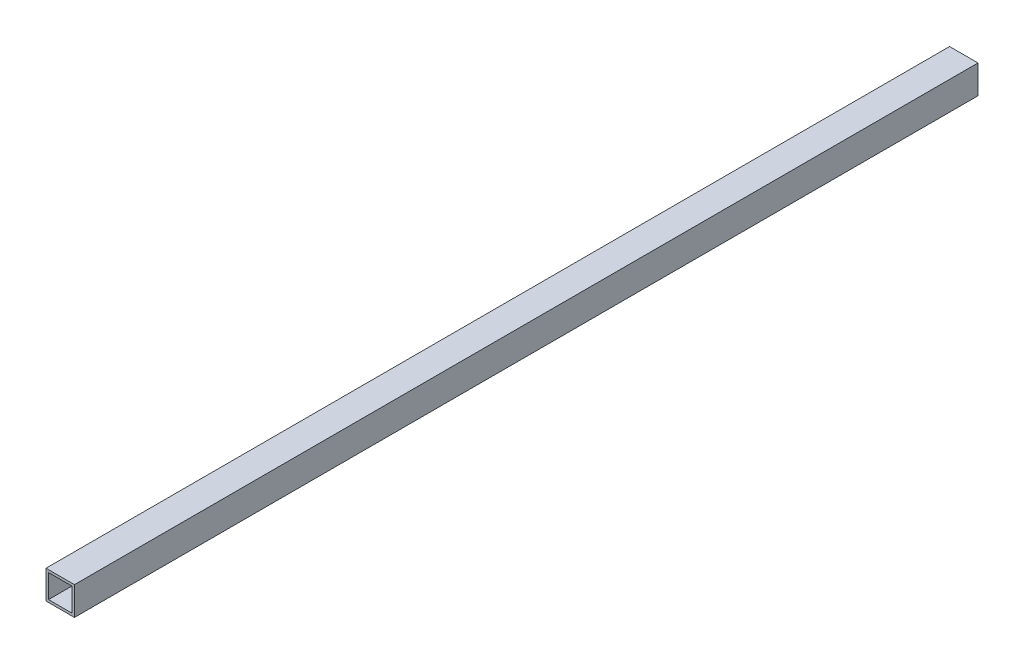
ISO-10303-21;
HEADER;
FILE_DESCRIPTION(('STEP AP214'),'2;1');
FILE_NAME('part.step','',(''),(''),'','','');
FILE_SCHEMA(('AUTOMOTIVE_DESIGN { 1 0 10303 214 1 1 1 1 }'));
ENDSEC;
DATA;
#1=APPLICATION_CONTEXT('core data for automotive mechanical design processes');
#2=APPLICATION_PROTOCOL_DEFINITION('international standard','automotive_design',2000,#1);
#3=PRODUCT_CONTEXT('',#1,'mechanical');
#4=PRODUCT('Part','Part','',(#3));
#5=PRODUCT_RELATED_PRODUCT_CATEGORY('part','',(#4));
#6=PRODUCT_DEFINITION_FORMATION('','',#4);
#7=PRODUCT_DEFINITION_CONTEXT('part definition',#1,'design');
#8=PRODUCT_DEFINITION('design','',#6,#7);
#9=PRODUCT_DEFINITION_SHAPE('','',#8);
#10=(LENGTH_UNIT() NAMED_UNIT(*) SI_UNIT(.MILLI.,.METRE.));
#11=(NAMED_UNIT(*) PLANE_ANGLE_UNIT() SI_UNIT($,.RADIAN.));
#12=(NAMED_UNIT(*) SI_UNIT($,.STERADIAN.) SOLID_ANGLE_UNIT());
#13=UNCERTAINTY_MEASURE_WITH_UNIT(LENGTH_MEASURE(1.E-05),#10,'distance_accuracy_value','');
#14=(GEOMETRIC_REPRESENTATION_CONTEXT(3) GLOBAL_UNCERTAINTY_ASSIGNED_CONTEXT((#13)) GLOBAL_UNIT_ASSIGNED_CONTEXT((#10,
#11,#12)) REPRESENTATION_CONTEXT('',''));
#15=CARTESIAN_POINT('',(0.,0.,0.));
#16=DIRECTION('',(0.,0.,1.));
#17=DIRECTION('',(1.,0.,0.));
#18=AXIS2_PLACEMENT_3D('',#15,#16,#17);
#19=CARTESIAN_POINT('',(0.,0.,540.));
#20=DIRECTION('',(0.,0.,1.));
#21=DIRECTION('',(1.,0.,0.));
#22=AXIS2_PLACEMENT_3D('',#19,#20,#21);
#23=PLANE('',#22);
#24=DIRECTION('',(0.,1.,0.));
#25=VECTOR('',#24,1.);
#26=CARTESIAN_POINT('',(8.5,8.5,540.));
#27=LINE('',#26,#25);
#28=CARTESIAN_POINT('',(8.5,-8.5,540.));
#29=VERTEX_POINT('',#28);
#30=CARTESIAN_POINT('',(8.5,8.5,540.));
#31=VERTEX_POINT('',#30);
#32=EDGE_CURVE('E153',#29,#31,#27,.T.);
#33=ORIENTED_EDGE('',*,*,#32,.T.);
#34=DIRECTION('',(-1.,0.,0.));
#35=VECTOR('',#34,1.);
#36=CARTESIAN_POINT('',(-8.5,8.5,540.));
#37=LINE('',#36,#35);
#38=CARTESIAN_POINT('',(-8.5,8.5,540.));
#39=VERTEX_POINT('',#38);
#40=EDGE_CURVE('E157',#31,#39,#37,.T.);
#41=ORIENTED_EDGE('',*,*,#40,.T.);
#42=DIRECTION('',(0.,-1.,0.));
#43=VECTOR('',#42,1.);
#44=CARTESIAN_POINT('',(-8.5,8.5,540.));
#45=LINE('',#44,#43);
#46=CARTESIAN_POINT('',(-8.5,-8.5,540.));
#47=VERTEX_POINT('',#46);
#48=EDGE_CURVE('E161',#39,#47,#45,.T.);
#49=ORIENTED_EDGE('',*,*,#48,.T.);
#50=DIRECTION('',(1.,0.,0.));
#51=VECTOR('',#50,1.);
#52=CARTESIAN_POINT('',(-8.5,-8.5,540.));
#53=LINE('',#52,#51);
#54=EDGE_CURVE('E164',#47,#29,#53,.T.);
#55=ORIENTED_EDGE('',*,*,#54,.T.);
#56=EDGE_LOOP('',(#33,#41,#49,#55));
#57=FACE_BOUND('',#56,.T.);
#58=DIRECTION('',(-1.,0.,0.));
#59=VECTOR('',#58,1.);
#60=CARTESIAN_POINT('',(-7.,7.,540.));
#61=LINE('',#60,#59);
#62=CARTESIAN_POINT('',(7.,7.,540.));
#63=VERTEX_POINT('',#62);
#64=CARTESIAN_POINT('',(-7.,7.,540.));
#65=VERTEX_POINT('',#64);
#66=EDGE_CURVE('E114',#63,#65,#61,.T.);
#67=ORIENTED_EDGE('',*,*,#66,.F.);
#68=DIRECTION('',(0.,1.,0.));
#69=VECTOR('',#68,1.);
#70=CARTESIAN_POINT('',(7.,7.,540.));
#71=LINE('',#70,#69);
#72=CARTESIAN_POINT('',(7.,-7.,540.));
#73=VERTEX_POINT('',#72);
#74=EDGE_CURVE('E105',#73,#63,#71,.T.);
#75=ORIENTED_EDGE('',*,*,#74,.F.);
#76=DIRECTION('',(1.,0.,0.));
#77=VECTOR('',#76,1.);
#78=CARTESIAN_POINT('',(-7.,-7.,540.));
#79=LINE('',#78,#77);
#80=CARTESIAN_POINT('',(-7.,-7.,540.));
#81=VERTEX_POINT('',#80);
#82=EDGE_CURVE('E131',#81,#73,#79,.T.);
#83=ORIENTED_EDGE('',*,*,#82,.F.);
#84=DIRECTION('',(0.,-1.,0.));
#85=VECTOR('',#84,1.);
#86=CARTESIAN_POINT('',(-7.,7.,540.));
#87=LINE('',#86,#85);
#88=EDGE_CURVE('E127',#65,#81,#87,.T.);
#89=ORIENTED_EDGE('',*,*,#88,.F.);
#90=EDGE_LOOP('',(#67,#75,#83,#89));
#91=FACE_BOUND('',#90,.T.);
#92=ADVANCED_FACE('F39',(#57,#91),#23,.T.);
#93=CARTESIAN_POINT('',(0.,0.,0.));
#94=DIRECTION('',(0.,0.,1.));
#95=DIRECTION('',(1.,0.,0.));
#96=AXIS2_PLACEMENT_3D('',#93,#94,#95);
#97=PLANE('',#96);
#98=DIRECTION('',(0.,1.,0.));
#99=VECTOR('',#98,1.);
#100=CARTESIAN_POINT('',(8.5,8.5,0.));
#101=LINE('',#100,#99);
#102=CARTESIAN_POINT('',(8.5,-8.5,0.));
#103=VERTEX_POINT('',#102);
#104=CARTESIAN_POINT('',(8.5,8.5,0.));
#105=VERTEX_POINT('',#104);
#106=EDGE_CURVE('E123',#103,#105,#101,.T.);
#107=ORIENTED_EDGE('',*,*,#106,.F.);
#108=DIRECTION('',(1.,0.,0.));
#109=VECTOR('',#108,1.);
#110=CARTESIAN_POINT('',(-8.5,-8.5,0.));
#111=LINE('',#110,#109);
#112=CARTESIAN_POINT('',(-8.5,-8.5,0.));
#113=VERTEX_POINT('',#112);
#114=EDGE_CURVE('E158',#113,#103,#111,.T.);
#115=ORIENTED_EDGE('',*,*,#114,.F.);
#116=DIRECTION('',(0.,-1.,0.));
#117=VECTOR('',#116,1.);
#118=CARTESIAN_POINT('',(-8.5,8.5,0.));
#119=LINE('',#118,#117);
#120=CARTESIAN_POINT('',(-8.5,8.5,0.));
#121=VERTEX_POINT('',#120);
#122=EDGE_CURVE('E174',#121,#113,#119,.T.);
#123=ORIENTED_EDGE('',*,*,#122,.F.);
#124=DIRECTION('',(-1.,0.,0.));
#125=VECTOR('',#124,1.);
#126=CARTESIAN_POINT('',(-8.5,8.5,0.));
#127=LINE('',#126,#125);
#128=EDGE_CURVE('E171',#105,#121,#127,.T.);
#129=ORIENTED_EDGE('',*,*,#128,.F.);
#130=EDGE_LOOP('',(#107,#115,#123,#129));
#131=FACE_BOUND('',#130,.T.);
#132=DIRECTION('',(0.,1.,0.));
#133=VECTOR('',#132,1.);
#134=CARTESIAN_POINT('',(7.,7.,0.));
#135=LINE('',#134,#133);
#136=CARTESIAN_POINT('',(7.,-7.,0.));
#137=VERTEX_POINT('',#136);
#138=CARTESIAN_POINT('',(7.,7.,0.));
#139=VERTEX_POINT('',#138);
#140=EDGE_CURVE('E63',#137,#139,#135,.T.);
#141=ORIENTED_EDGE('',*,*,#140,.T.);
#142=DIRECTION('',(-1.,0.,0.));
#143=VECTOR('',#142,1.);
#144=CARTESIAN_POINT('',(-7.,7.,0.));
#145=LINE('',#144,#143);
#146=CARTESIAN_POINT('',(-7.,7.,0.));
#147=VERTEX_POINT('',#146);
#148=EDGE_CURVE('E121',#139,#147,#145,.T.);
#149=ORIENTED_EDGE('',*,*,#148,.T.);
#150=DIRECTION('',(0.,-1.,0.));
#151=VECTOR('',#150,1.);
#152=CARTESIAN_POINT('',(-7.,7.,0.));
#153=LINE('',#152,#151);
#154=CARTESIAN_POINT('',(-7.,-7.,0.));
#155=VERTEX_POINT('',#154);
#156=EDGE_CURVE('E140',#147,#155,#153,.T.);
#157=ORIENTED_EDGE('',*,*,#156,.T.);
#158=DIRECTION('',(1.,0.,0.));
#159=VECTOR('',#158,1.);
#160=CARTESIAN_POINT('',(-7.,-7.,0.));
#161=LINE('',#160,#159);
#162=EDGE_CURVE('E115',#155,#137,#161,.T.);
#163=ORIENTED_EDGE('',*,*,#162,.T.);
#164=EDGE_LOOP('',(#141,#149,#157,#163));
#165=FACE_BOUND('',#164,.T.);
#166=ADVANCED_FACE('F197',(#131,#165),#97,.F.);
#167=CARTESIAN_POINT('',(8.5,8.5,540.));
#168=DIRECTION('',(-1.,0.,0.));
#169=DIRECTION('',(0.,-1.,0.));
#170=AXIS2_PLACEMENT_3D('',#167,#168,#169);
#171=PLANE('',#170);
#172=ORIENTED_EDGE('',*,*,#106,.T.);
#173=DIRECTION('',(0.,0.,-1.));
#174=VECTOR('',#173,1.);
#175=CARTESIAN_POINT('',(8.5,8.5,540.));
#176=LINE('',#175,#174);
#177=EDGE_CURVE('E11',#31,#105,#176,.T.);
#178=ORIENTED_EDGE('',*,*,#177,.F.);
#179=ORIENTED_EDGE('',*,*,#32,.F.);
#180=DIRECTION('',(0.,0.,-1.));
#181=VECTOR('',#180,1.);
#182=CARTESIAN_POINT('',(8.5,-8.5,540.));
#183=LINE('',#182,#181);
#184=EDGE_CURVE('E167',#29,#103,#183,.T.);
#185=ORIENTED_EDGE('',*,*,#184,.T.);
#186=EDGE_LOOP('',(#172,#178,#179,#185));
#187=FACE_BOUND('',#186,.T.);
#188=ADVANCED_FACE('F41',(#187),#171,.F.);
#189=CARTESIAN_POINT('',(-8.5,8.5,540.));
#190=DIRECTION('',(0.,-1.,0.));
#191=DIRECTION('',(0.,0.,-1.));
#192=AXIS2_PLACEMENT_3D('',#189,#190,#191);
#193=PLANE('',#192);
#194=ORIENTED_EDGE('',*,*,#128,.T.);
#195=DIRECTION('',(0.,0.,-1.));
#196=VECTOR('',#195,1.);
#197=CARTESIAN_POINT('',(-8.5,8.5,540.));
#198=LINE('',#197,#196);
#199=EDGE_CURVE('E48',#39,#121,#198,.T.);
#200=ORIENTED_EDGE('',*,*,#199,.F.);
#201=ORIENTED_EDGE('',*,*,#40,.F.);
#202=ORIENTED_EDGE('',*,*,#177,.T.);
#203=EDGE_LOOP('',(#194,#200,#201,#202));
#204=FACE_BOUND('',#203,.T.);
#205=ADVANCED_FACE('F207',(#204),#193,.F.);
#206=CARTESIAN_POINT('',(-8.5,8.5,540.));
#207=DIRECTION('',(1.,0.,0.));
#208=DIRECTION('',(0.,1.,0.));
#209=AXIS2_PLACEMENT_3D('',#206,#207,#208);
#210=PLANE('',#209);
#211=ORIENTED_EDGE('',*,*,#122,.T.);
#212=DIRECTION('',(0.,0.,-1.));
#213=VECTOR('',#212,1.);
#214=CARTESIAN_POINT('',(-8.5,-8.5,540.));
#215=LINE('',#214,#213);
#216=EDGE_CURVE('E182',#47,#113,#215,.T.);
#217=ORIENTED_EDGE('',*,*,#216,.F.);
#218=ORIENTED_EDGE('',*,*,#48,.F.);
#219=ORIENTED_EDGE('',*,*,#199,.T.);
#220=EDGE_LOOP('',(#211,#217,#218,#219));
#221=FACE_BOUND('',#220,.T.);
#222=ADVANCED_FACE('F191',(#221),#210,.F.);
#223=CARTESIAN_POINT('',(-8.5,-8.5,540.));
#224=DIRECTION('',(0.,1.,0.));
#225=DIRECTION('',(0.,0.,1.));
#226=AXIS2_PLACEMENT_3D('',#223,#224,#225);
#227=PLANE('',#226);
#228=ORIENTED_EDGE('',*,*,#114,.T.);
#229=ORIENTED_EDGE('',*,*,#184,.F.);
#230=ORIENTED_EDGE('',*,*,#54,.F.);
#231=ORIENTED_EDGE('',*,*,#216,.T.);
#232=EDGE_LOOP('',(#228,#229,#230,#231));
#233=FACE_BOUND('',#232,.T.);
#234=ADVANCED_FACE('F201',(#233),#227,.F.);
#235=CARTESIAN_POINT('',(7.,7.,540.));
#236=DIRECTION('',(-1.,0.,0.));
#237=DIRECTION('',(0.,0.,1.));
#238=AXIS2_PLACEMENT_3D('',#235,#236,#237);
#239=PLANE('',#238);
#240=ORIENTED_EDGE('',*,*,#140,.F.);
#241=DIRECTION('',(0.,0.,-1.));
#242=VECTOR('',#241,1.);
#243=CARTESIAN_POINT('',(7.,-7.,540.));
#244=LINE('',#243,#242);
#245=EDGE_CURVE('E109',#73,#137,#244,.T.);
#246=ORIENTED_EDGE('',*,*,#245,.F.);
#247=ORIENTED_EDGE('',*,*,#74,.T.);
#248=DIRECTION('',(0.,0.,-1.));
#249=VECTOR('',#248,1.);
#250=CARTESIAN_POINT('',(7.,7.,540.));
#251=LINE('',#250,#249);
#252=EDGE_CURVE('E108',#63,#139,#251,.T.);
#253=ORIENTED_EDGE('',*,*,#252,.T.);
#254=EDGE_LOOP('',(#240,#246,#247,#253));
#255=FACE_BOUND('',#254,.T.);
#256=ADVANCED_FACE('F107',(#255),#239,.T.);
#257=CARTESIAN_POINT('',(-7.,7.,540.));
#258=DIRECTION('',(0.,-1.,0.));
#259=DIRECTION('',(0.,0.,-1.));
#260=AXIS2_PLACEMENT_3D('',#257,#258,#259);
#261=PLANE('',#260);
#262=ORIENTED_EDGE('',*,*,#148,.F.);
#263=ORIENTED_EDGE('',*,*,#252,.F.);
#264=ORIENTED_EDGE('',*,*,#66,.T.);
#265=DIRECTION('',(0.,0.,-1.));
#266=VECTOR('',#265,1.);
#267=CARTESIAN_POINT('',(-7.,7.,540.));
#268=LINE('',#267,#266);
#269=EDGE_CURVE('E124',#65,#147,#268,.T.);
#270=ORIENTED_EDGE('',*,*,#269,.T.);
#271=EDGE_LOOP('',(#262,#263,#264,#270));
#272=FACE_BOUND('',#271,.T.);
#273=ADVANCED_FACE('F118',(#272),#261,.T.);
#274=CARTESIAN_POINT('',(-7.,7.,540.));
#275=DIRECTION('',(1.,0.,0.));
#276=DIRECTION('',(0.,0.,-1.));
#277=AXIS2_PLACEMENT_3D('',#274,#275,#276);
#278=PLANE('',#277);
#279=ORIENTED_EDGE('',*,*,#156,.F.);
#280=ORIENTED_EDGE('',*,*,#269,.F.);
#281=ORIENTED_EDGE('',*,*,#88,.T.);
#282=DIRECTION('',(0.,0.,-1.));
#283=VECTOR('',#282,1.);
#284=CARTESIAN_POINT('',(-7.,-7.,540.));
#285=LINE('',#284,#283);
#286=EDGE_CURVE('E55',#81,#155,#285,.T.);
#287=ORIENTED_EDGE('',*,*,#286,.T.);
#288=EDGE_LOOP('',(#279,#280,#281,#287));
#289=FACE_BOUND('',#288,.T.);
#290=ADVANCED_FACE('F230',(#289),#278,.T.);
#291=CARTESIAN_POINT('',(-7.,-7.,540.));
#292=DIRECTION('',(0.,1.,0.));
#293=DIRECTION('',(0.,0.,1.));
#294=AXIS2_PLACEMENT_3D('',#291,#292,#293);
#295=PLANE('',#294);
#296=ORIENTED_EDGE('',*,*,#162,.F.);
#297=ORIENTED_EDGE('',*,*,#286,.F.);
#298=ORIENTED_EDGE('',*,*,#82,.T.);
#299=ORIENTED_EDGE('',*,*,#245,.T.);
#300=EDGE_LOOP('',(#296,#297,#298,#299));
#301=FACE_BOUND('',#300,.T.);
#302=ADVANCED_FACE('F234',(#301),#295,.T.);
#303=CLOSED_SHELL('',(#92,#166,#188,#205,#222,#234,#256,#273,#290,#302));
#304=MANIFOLD_SOLID_BREP('B2',#303);
#305=ADVANCED_BREP_SHAPE_REPRESENTATION('',(#18,#304),#14);
#306=SHAPE_DEFINITION_REPRESENTATION(#9,#305);
ENDSEC;
END-ISO-10303-21;
